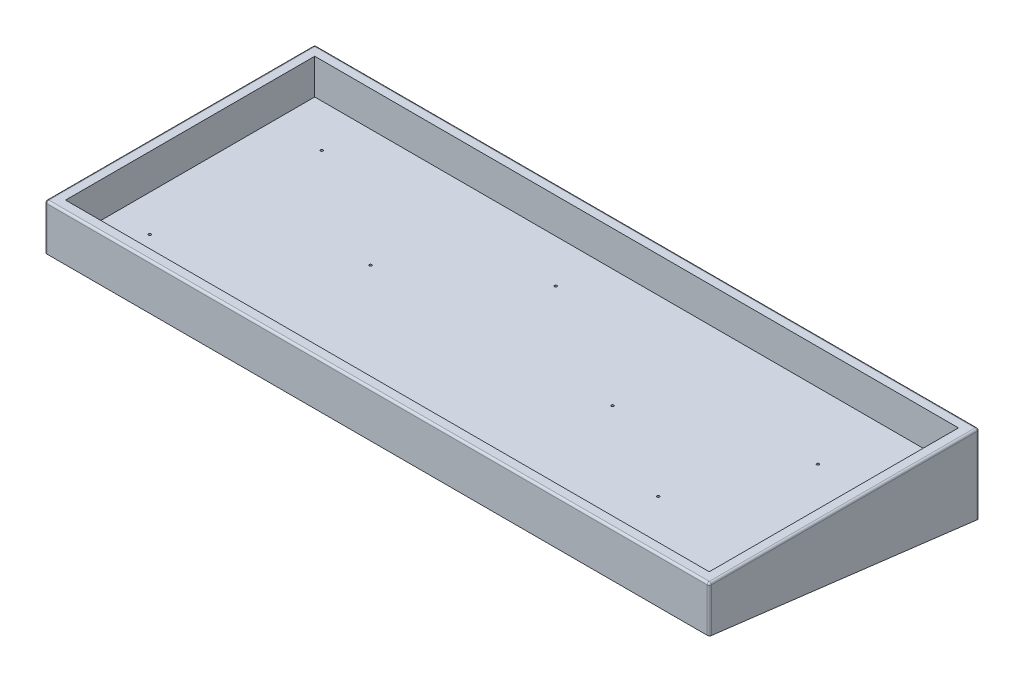
ISO-10303-21;
HEADER;
FILE_DESCRIPTION(('STEP AP214'),'2;1');
FILE_NAME('part.step','',(''),(''),'','','');
FILE_SCHEMA(('AUTOMOTIVE_DESIGN { 1 0 10303 214 1 1 1 1 }'));
ENDSEC;
DATA;
#1=APPLICATION_CONTEXT('core data for automotive mechanical design processes');
#2=APPLICATION_PROTOCOL_DEFINITION('international standard','automotive_design',2000,#1);
#3=PRODUCT_CONTEXT('',#1,'mechanical');
#4=PRODUCT('Part','Part','',(#3));
#5=PRODUCT_RELATED_PRODUCT_CATEGORY('part','',(#4));
#6=PRODUCT_DEFINITION_FORMATION('','',#4);
#7=PRODUCT_DEFINITION_CONTEXT('part definition',#1,'design');
#8=PRODUCT_DEFINITION('design','',#6,#7);
#9=PRODUCT_DEFINITION_SHAPE('','',#8);
#10=(LENGTH_UNIT() NAMED_UNIT(*) SI_UNIT(.MILLI.,.METRE.));
#11=(NAMED_UNIT(*) PLANE_ANGLE_UNIT() SI_UNIT($,.RADIAN.));
#12=(NAMED_UNIT(*) SI_UNIT($,.STERADIAN.) SOLID_ANGLE_UNIT());
#13=UNCERTAINTY_MEASURE_WITH_UNIT(LENGTH_MEASURE(1.E-05),#10,'distance_accuracy_value','');
#14=(GEOMETRIC_REPRESENTATION_CONTEXT(3) GLOBAL_UNCERTAINTY_ASSIGNED_CONTEXT((#13)) GLOBAL_UNIT_ASSIGNED_CONTEXT((#10,
#11,#12)) REPRESENTATION_CONTEXT('',''));
#15=CARTESIAN_POINT('',(0.,0.,0.));
#16=DIRECTION('',(0.,0.,1.));
#17=DIRECTION('',(1.,0.,0.));
#18=AXIS2_PLACEMENT_3D('',#15,#16,#17);
#19=CARTESIAN_POINT('',(0.,22.,0.));
#20=DIRECTION('',(1.,0.,0.));
#21=DIRECTION('',(0.,0.,-1.));
#22=AXIS2_PLACEMENT_3D('',#19,#20,#21);
#23=PLANE('',#22);
#24=DIRECTION('',(0.,0.,1.));
#25=VECTOR('',#24,1.);
#26=CARTESIAN_POINT('',(0.,21.,0.));
#27=LINE('',#26,#25);
#28=CARTESIAN_POINT('',(0.,21.,-1.));
#29=VERTEX_POINT('',#28);
#30=CARTESIAN_POINT('',(0.,21.,-129.));
#31=VERTEX_POINT('',#30);
#32=EDGE_CURVE('E267',#29,#31,#27,.F.);
#33=ORIENTED_EDGE('',*,*,#32,.T.);
#34=DIRECTION('',(0.,-1.,0.));
#35=VECTOR('',#34,1.);
#36=CARTESIAN_POINT('',(0.,22.,-129.));
#37=LINE('',#36,#35);
#38=CARTESIAN_POINT('',(0.,-15.8392083564747,-129.));
#39=VERTEX_POINT('',#38);
#40=EDGE_CURVE('E273',#31,#39,#37,.T.);
#41=ORIENTED_EDGE('',*,*,#40,.T.);
#42=DIRECTION('',(0.,0.121869343405148,0.992546151641322));
#43=VECTOR('',#42,1.);
#44=CARTESIAN_POINT('',(0.,0.,0.));
#45=LINE('',#44,#43);
#46=CARTESIAN_POINT('',(0.,-0.122784560902905,-1.));
#47=VERTEX_POINT('',#46);
#48=EDGE_CURVE('E206',#39,#47,#45,.T.);
#49=ORIENTED_EDGE('',*,*,#48,.T.);
#50=DIRECTION('',(0.,-1.,0.));
#51=VECTOR('',#50,1.);
#52=CARTESIAN_POINT('',(0.,22.,-1.));
#53=LINE('',#52,#51);
#54=EDGE_CURVE('E270',#47,#29,#53,.F.);
#55=ORIENTED_EDGE('',*,*,#54,.T.);
#56=EDGE_LOOP('',(#33,#41,#49,#55));
#57=FACE_BOUND('',#56,.T.);
#58=ADVANCED_FACE('F49',(#57),#23,.F.);
#59=CARTESIAN_POINT('',(0.,22.,0.));
#60=DIRECTION('',(0.,0.,-1.));
#61=DIRECTION('',(-1.,0.,0.));
#62=AXIS2_PLACEMENT_3D('',#59,#60,#61);
#63=PLANE('',#62);
#64=DIRECTION('',(1.,0.,0.));
#65=VECTOR('',#64,1.);
#66=CARTESIAN_POINT('',(0.,0.,0.));
#67=LINE('',#66,#65);
#68=CARTESIAN_POINT('',(1.,0.,0.));
#69=VERTEX_POINT('',#68);
#70=CARTESIAN_POINT('',(319.,0.,0.));
#71=VERTEX_POINT('',#70);
#72=EDGE_CURVE('E212',#69,#71,#67,.T.);
#73=ORIENTED_EDGE('',*,*,#72,.T.);
#74=DIRECTION('',(0.,-1.,0.));
#75=VECTOR('',#74,1.);
#76=CARTESIAN_POINT('',(319.,22.,0.));
#77=LINE('',#76,#75);
#78=CARTESIAN_POINT('',(319.,21.,0.));
#79=VERTEX_POINT('',#78);
#80=EDGE_CURVE('E264',#71,#79,#77,.F.);
#81=ORIENTED_EDGE('',*,*,#80,.T.);
#82=DIRECTION('',(1.,0.,0.));
#83=VECTOR('',#82,1.);
#84=CARTESIAN_POINT('',(0.,21.,0.));
#85=LINE('',#84,#83);
#86=CARTESIAN_POINT('',(1.,21.,0.));
#87=VERTEX_POINT('',#86);
#88=EDGE_CURVE('E258',#79,#87,#85,.F.);
#89=ORIENTED_EDGE('',*,*,#88,.T.);
#90=DIRECTION('',(0.,-1.,0.));
#91=VECTOR('',#90,1.);
#92=CARTESIAN_POINT('',(1.,22.,0.));
#93=LINE('',#92,#91);
#94=EDGE_CURVE('E261',#87,#69,#93,.T.);
#95=ORIENTED_EDGE('',*,*,#94,.T.);
#96=EDGE_LOOP('',(#73,#81,#89,#95));
#97=FACE_BOUND('',#96,.T.);
#98=ADVANCED_FACE('F397',(#97),#63,.F.);
#99=CARTESIAN_POINT('',(320.,22.,0.));
#100=DIRECTION('',(-1.,0.,0.));
#101=DIRECTION('',(0.,0.,1.));
#102=AXIS2_PLACEMENT_3D('',#99,#100,#101);
#103=PLANE('',#102);
#104=DIRECTION('',(0.,-0.121869343405148,-0.992546151641322));
#105=VECTOR('',#104,1.);
#106=CARTESIAN_POINT('',(320.,0.,0.));
#107=LINE('',#106,#105);
#108=CARTESIAN_POINT('',(320.,-0.122784560902905,-1.));
#109=VERTEX_POINT('',#108);
#110=CARTESIAN_POINT('',(320.,-15.8392083564747,-129.));
#111=VERTEX_POINT('',#110);
#112=EDGE_CURVE('E216',#109,#111,#107,.T.);
#113=ORIENTED_EDGE('',*,*,#112,.T.);
#114=DIRECTION('',(0.,-1.,0.));
#115=VECTOR('',#114,1.);
#116=CARTESIAN_POINT('',(320.,22.,-129.));
#117=LINE('',#116,#115);
#118=CARTESIAN_POINT('',(320.,21.,-129.));
#119=VERTEX_POINT('',#118);
#120=EDGE_CURVE('E255',#111,#119,#117,.F.);
#121=ORIENTED_EDGE('',*,*,#120,.T.);
#122=DIRECTION('',(0.,0.,-1.));
#123=VECTOR('',#122,1.);
#124=CARTESIAN_POINT('',(320.,21.,0.));
#125=LINE('',#124,#123);
#126=CARTESIAN_POINT('',(320.,21.,-1.));
#127=VERTEX_POINT('',#126);
#128=EDGE_CURVE('E249',#119,#127,#125,.F.);
#129=ORIENTED_EDGE('',*,*,#128,.T.);
#130=DIRECTION('',(0.,-1.,0.));
#131=VECTOR('',#130,1.);
#132=CARTESIAN_POINT('',(320.,22.,-1.));
#133=LINE('',#132,#131);
#134=EDGE_CURVE('E252',#127,#109,#133,.T.);
#135=ORIENTED_EDGE('',*,*,#134,.T.);
#136=EDGE_LOOP('',(#113,#121,#129,#135));
#137=FACE_BOUND('',#136,.T.);
#138=ADVANCED_FACE('F403',(#137),#103,.F.);
#139=CARTESIAN_POINT('',(0.,22.,-130.));
#140=DIRECTION('',(0.,0.,1.));
#141=DIRECTION('',(1.,0.,0.));
#142=AXIS2_PLACEMENT_3D('',#139,#140,#141);
#143=PLANE('',#142);
#144=DIRECTION('',(-1.,0.,0.));
#145=VECTOR('',#144,1.);
#146=CARTESIAN_POINT('',(0.,21.,-130.));
#147=LINE('',#146,#145);
#148=CARTESIAN_POINT('',(1.,21.,-130.));
#149=VERTEX_POINT('',#148);
#150=CARTESIAN_POINT('',(319.,21.,-130.));
#151=VERTEX_POINT('',#150);
#152=EDGE_CURVE('E227',#149,#151,#147,.F.);
#153=ORIENTED_EDGE('',*,*,#152,.T.);
#154=DIRECTION('',(0.,-1.,0.));
#155=VECTOR('',#154,1.);
#156=CARTESIAN_POINT('',(319.,22.,-130.));
#157=LINE('',#156,#155);
#158=CARTESIAN_POINT('',(319.,-15.9619929173776,-130.));
#159=VERTEX_POINT('',#158);
#160=EDGE_CURVE('E233',#151,#159,#157,.T.);
#161=ORIENTED_EDGE('',*,*,#160,.T.);
#162=DIRECTION('',(-1.,0.,0.));
#163=VECTOR('',#162,1.);
#164=CARTESIAN_POINT('',(0.,-15.9619929173776,-130.));
#165=LINE('',#164,#163);
#166=CARTESIAN_POINT('',(1.,-15.9619929173776,-130.));
#167=VERTEX_POINT('',#166);
#168=EDGE_CURVE('E223',#159,#167,#165,.T.);
#169=ORIENTED_EDGE('',*,*,#168,.T.);
#170=DIRECTION('',(0.,-1.,0.));
#171=VECTOR('',#170,1.);
#172=CARTESIAN_POINT('',(1.,22.,-130.));
#173=LINE('',#172,#171);
#174=EDGE_CURVE('E230',#167,#149,#173,.F.);
#175=ORIENTED_EDGE('',*,*,#174,.T.);
#176=EDGE_LOOP('',(#153,#161,#169,#175));
#177=FACE_BOUND('',#176,.T.);
#178=ADVANCED_FACE('F469',(#177),#143,.F.);
#179=CARTESIAN_POINT('',(0.,22.,0.));
#180=DIRECTION('',(0.,-1.,0.));
#181=DIRECTION('',(0.,0.,-1.));
#182=AXIS2_PLACEMENT_3D('',#179,#180,#181);
#183=PLANE('',#182);
#184=DIRECTION('',(-1.,0.,0.));
#185=VECTOR('',#184,1.);
#186=CARTESIAN_POINT('',(0.,22.,-129.));
#187=LINE('',#186,#185);
#188=CARTESIAN_POINT('',(319.,22.,-129.));
#189=VERTEX_POINT('',#188);
#190=CARTESIAN_POINT('',(1.,22.,-129.));
#191=VERTEX_POINT('',#190);
#192=EDGE_CURVE('E59',#189,#191,#187,.T.);
#193=ORIENTED_EDGE('',*,*,#192,.T.);
#194=DIRECTION('',(0.,0.,1.));
#195=VECTOR('',#194,1.);
#196=CARTESIAN_POINT('',(1.,22.,0.));
#197=LINE('',#196,#195);
#198=CARTESIAN_POINT('',(1.,22.,-1.));
#199=VERTEX_POINT('',#198);
#200=EDGE_CURVE('E11',#191,#199,#197,.T.);
#201=ORIENTED_EDGE('',*,*,#200,.T.);
#202=DIRECTION('',(1.,0.,0.));
#203=VECTOR('',#202,1.);
#204=CARTESIAN_POINT('',(0.,22.,-1.));
#205=LINE('',#204,#203);
#206=CARTESIAN_POINT('',(319.,22.,-1.));
#207=VERTEX_POINT('',#206);
#208=EDGE_CURVE('E73',#199,#207,#205,.T.);
#209=ORIENTED_EDGE('',*,*,#208,.T.);
#210=DIRECTION('',(0.,0.,-1.));
#211=VECTOR('',#210,1.);
#212=CARTESIAN_POINT('',(319.,22.,0.));
#213=LINE('',#212,#211);
#214=EDGE_CURVE('E276',#207,#189,#213,.T.);
#215=ORIENTED_EDGE('',*,*,#214,.T.);
#216=EDGE_LOOP('',(#193,#201,#209,#215));
#217=FACE_BOUND('',#216,.T.);
#218=DIRECTION('',(0.,0.,1.));
#219=VECTOR('',#218,1.);
#220=CARTESIAN_POINT('',(5.,22.,-125.));
#221=LINE('',#220,#219);
#222=CARTESIAN_POINT('',(5.,22.,-125.));
#223=VERTEX_POINT('',#222);
#224=CARTESIAN_POINT('',(5.,22.,-5.));
#225=VERTEX_POINT('',#224);
#226=EDGE_CURVE('E196',#223,#225,#221,.T.);
#227=ORIENTED_EDGE('',*,*,#226,.F.);
#228=DIRECTION('',(-1.,0.,0.));
#229=VECTOR('',#228,1.);
#230=CARTESIAN_POINT('',(315.,22.,-125.));
#231=LINE('',#230,#229);
#232=CARTESIAN_POINT('',(315.,22.,-125.));
#233=VERTEX_POINT('',#232);
#234=EDGE_CURVE('E160',#233,#223,#231,.T.);
#235=ORIENTED_EDGE('',*,*,#234,.F.);
#236=DIRECTION('',(0.,0.,-1.));
#237=VECTOR('',#236,1.);
#238=CARTESIAN_POINT('',(315.,22.,-5.));
#239=LINE('',#238,#237);
#240=CARTESIAN_POINT('',(315.,22.,-5.));
#241=VERTEX_POINT('',#240);
#242=EDGE_CURVE('E180',#241,#233,#239,.T.);
#243=ORIENTED_EDGE('',*,*,#242,.F.);
#244=DIRECTION('',(1.,0.,0.));
#245=VECTOR('',#244,1.);
#246=CARTESIAN_POINT('',(5.,22.,-5.));
#247=LINE('',#246,#245);
#248=EDGE_CURVE('E184',#225,#241,#247,.T.);
#249=ORIENTED_EDGE('',*,*,#248,.F.);
#250=EDGE_LOOP('',(#227,#235,#243,#249));
#251=FACE_BOUND('',#250,.T.);
#252=ADVANCED_FACE('F411',(#217,#251),#183,.F.);
#253=CARTESIAN_POINT('',(0.,0.,0.));
#254=DIRECTION('',(0.,-0.992546151641322,0.121869343405148));
#255=DIRECTION('',(0.,-0.121869343405148,-0.992546151641322));
#256=AXIS2_PLACEMENT_3D('',#253,#254,#255);
#257=PLANE('',#256);
#258=CARTESIAN_POINT('',(28.9711100203235,-12.822626306714,-104.431910758339));
#259=DIRECTION('',(0.,-0.992546151641322,0.121869343405148));
#260=DIRECTION('',(0.,0.121869343405148,0.992546151641322));
#261=AXIS2_PLACEMENT_3D('',#258,#259,#260);
#262=ELLIPSE('',#261,0.600103077338052,0.595629999999998);
#263=CARTESIAN_POINT('',(28.9711100203235,-12.7494921387034,-103.836280758339));
#264=VERTEX_POINT('',#263);
#265=EDGE_CURVE('E53',#264,#264,#262,.T.);
#266=ORIENTED_EDGE('',*,*,#265,.F.);
#267=EDGE_LOOP('',(#266));
#268=FACE_BOUND('',#267,.T.);
#269=CARTESIAN_POINT('',(141.933618189267,-12.7856395014766,-104.130677403222));
#270=DIRECTION('',(0.,-0.992546151641322,0.121869343405148));
#271=DIRECTION('',(0.,0.121869343405148,0.992546151641322));
#272=AXIS2_PLACEMENT_3D('',#269,#270,#271);
#273=ELLIPSE('',#272,0.60010307733804,0.595629999999986);
#274=CARTESIAN_POINT('',(141.933618189267,-12.712505333466,-103.535047403222));
#275=VERTEX_POINT('',#274);
#276=EDGE_CURVE('E773',#275,#275,#273,.T.);
#277=ORIENTED_EDGE('',*,*,#276,.F.);
#278=EDGE_LOOP('',(#277));
#279=FACE_BOUND('',#278,.T.);
#280=CARTESIAN_POINT('',(88.6153143335257,-8.38420967822933,-68.2839081442769));
#281=DIRECTION('',(0.,-0.992546151641322,0.121869343405148));
#282=DIRECTION('',(0.,0.121869343405148,0.992546151641322));
#283=AXIS2_PLACEMENT_3D('',#280,#281,#282);
#284=ELLIPSE('',#283,0.600103077338054,0.59563);
#285=CARTESIAN_POINT('',(88.6153143335257,-8.31107551021873,-67.6882781442769));
#286=VERTEX_POINT('',#285);
#287=EDGE_CURVE('E354',#286,#286,#284,.T.);
#288=ORIENTED_EDGE('',*,*,#287,.F.);
#289=EDGE_LOOP('',(#288));
#290=FACE_BOUND('',#289,.T.);
#291=CARTESIAN_POINT('',(205.493856118993,-8.34722287299195,-67.9826747891597));
#292=DIRECTION('',(0.,-0.992546151641322,0.121869343405148));
#293=DIRECTION('',(0.,0.121869343405148,0.992546151641322));
#294=AXIS2_PLACEMENT_3D('',#291,#292,#293);
#295=ELLIPSE('',#294,0.60010307733804,0.595629999999986);
#296=CARTESIAN_POINT('',(205.493856118993,-8.27408870498136,-67.3870447891597));
#297=VERTEX_POINT('',#296);
#298=EDGE_CURVE('E343',#297,#297,#295,.T.);
#299=ORIENTED_EDGE('',*,*,#298,.F.);
#300=EDGE_LOOP('',(#299));
#301=FACE_BOUND('',#300,.T.);
#302=CARTESIAN_POINT('',(254.293659647976,-5.05539720686584,-41.1729061837304));
#303=DIRECTION('',(0.,-0.992546151641322,0.121869343405148));
#304=DIRECTION('',(0.,0.121869343405148,0.992546151641322));
#305=AXIS2_PLACEMENT_3D('',#302,#303,#304);
#306=ELLIPSE('',#305,0.600103077338068,0.595630000000014);
#307=CARTESIAN_POINT('',(254.293659647976,-4.98226303885524,-40.5772761837304));
#308=VERTEX_POINT('',#307);
#309=EDGE_CURVE('E339',#308,#308,#306,.T.);
#310=ORIENTED_EDGE('',*,*,#309,.F.);
#311=EDGE_LOOP('',(#310));
#312=FACE_BOUND('',#311,.T.);
#313=CARTESIAN_POINT('',(279.296028122702,-11.4171277076938,-92.9850432638859));
#314=DIRECTION('',(0.,-0.992546151641322,0.121869343405148));
#315=DIRECTION('',(0.,0.121869343405148,0.992546151641322));
#316=AXIS2_PLACEMENT_3D('',#313,#314,#315);
#317=ELLIPSE('',#316,0.600103077338068,0.595630000000014);
#318=CARTESIAN_POINT('',(279.296028122702,-11.3439935396832,-92.3894132638859));
#319=VERTEX_POINT('',#318);
#320=EDGE_CURVE('E333',#319,#319,#317,.T.);
#321=ORIENTED_EDGE('',*,*,#320,.F.);
#322=EDGE_LOOP('',(#321));
#323=FACE_BOUND('',#322,.T.);
#324=CARTESIAN_POINT('',(22.6452095628627,-3.42797777642146,-27.9186385585744));
#325=DIRECTION('',(0.,-0.992546151641322,0.121869343405148));
#326=DIRECTION('',(0.,0.121869343405148,0.992546151641322));
#327=AXIS2_PLACEMENT_3D('',#324,#325,#326);
#328=ELLIPSE('',#327,0.600103077338052,0.595629999999998);
#329=CARTESIAN_POINT('',(22.6452095628627,-3.35484360841087,-27.3230085585744));
#330=VERTEX_POINT('',#329);
#331=EDGE_CURVE('E369',#330,#330,#328,.T.);
#332=ORIENTED_EDGE('',*,*,#331,.F.);
#333=EDGE_LOOP('',(#332));
#334=FACE_BOUND('',#333,.T.);
#335=CARTESIAN_POINT('',(168.140920084462,-2.54029445072454,-20.689038035762));
#336=DIRECTION('',(0.,-0.992546151641322,0.121869343405148));
#337=DIRECTION('',(0.,0.121869343405148,0.992546151641322));
#338=AXIS2_PLACEMENT_3D('',#335,#336,#337);
#339=ELLIPSE('',#338,0.60010307733804,0.595629999999986);
#340=CARTESIAN_POINT('',(168.140920084462,-2.46716028271394,-20.093408035762));
#341=VERTEX_POINT('',#340);
#342=EDGE_CURVE('E288',#341,#341,#339,.T.);
#343=ORIENTED_EDGE('',*,*,#342,.F.);
#344=EDGE_LOOP('',(#343));
#345=FACE_BOUND('',#344,.T.);
#346=ORIENTED_EDGE('',*,*,#168,.F.);
#347=CARTESIAN_POINT('',(319.,-15.8392083564747,-129.));
#348=DIRECTION('',(0.,-0.992546151641322,0.121869343405148));
#349=DIRECTION('',(0.,-0.121869343405148,-0.992546151641322));
#350=AXIS2_PLACEMENT_3D('',#347,#348,#349);
#351=ELLIPSE('',#350,1.00750982545885,1.);
#352=EDGE_CURVE('E246',#159,#111,#351,.T.);
#353=ORIENTED_EDGE('',*,*,#352,.T.);
#354=ORIENTED_EDGE('',*,*,#112,.F.);
#355=CARTESIAN_POINT('',(319.,-0.122784560902905,-1.));
#356=DIRECTION('',(0.,-0.992546151641322,0.121869343405148));
#357=DIRECTION('',(0.,-0.121869343405148,-0.992546151641322));
#358=AXIS2_PLACEMENT_3D('',#355,#356,#357);
#359=ELLIPSE('',#358,1.00750982545885,1.);
#360=EDGE_CURVE('E243',#109,#71,#359,.T.);
#361=ORIENTED_EDGE('',*,*,#360,.T.);
#362=ORIENTED_EDGE('',*,*,#72,.F.);
#363=CARTESIAN_POINT('',(1.,-0.122784560902905,-1.));
#364=DIRECTION('',(0.,-0.992546151641322,0.121869343405148));
#365=DIRECTION('',(0.,-0.121869343405148,-0.992546151641322));
#366=AXIS2_PLACEMENT_3D('',#363,#364,#365);
#367=ELLIPSE('',#366,1.00750982545885,1.);
#368=EDGE_CURVE('E237',#69,#47,#367,.T.);
#369=ORIENTED_EDGE('',*,*,#368,.T.);
#370=ORIENTED_EDGE('',*,*,#48,.F.);
#371=CARTESIAN_POINT('',(1.,-15.8392083564747,-129.));
#372=DIRECTION('',(0.,-0.992546151641322,0.121869343405148));
#373=DIRECTION('',(0.,-0.121869343405148,-0.992546151641322));
#374=AXIS2_PLACEMENT_3D('',#371,#372,#373);
#375=ELLIPSE('',#374,1.00750982545885,1.);
#376=EDGE_CURVE('E240',#39,#167,#375,.T.);
#377=ORIENTED_EDGE('',*,*,#376,.T.);
#378=EDGE_LOOP('',(#346,#353,#354,#361,#362,#369,#370,#377));
#379=FACE_BOUND('',#378,.T.);
#380=ADVANCED_FACE('F408',(#268,#279,#290,#301,#312,#323,#334,#345,#379),#257,.T.);
#381=CARTESIAN_POINT('',(315.,5.,-125.));
#382=DIRECTION('',(0.,0.,-1.));
#383=DIRECTION('',(-1.,0.,0.));
#384=AXIS2_PLACEMENT_3D('',#381,#382,#383);
#385=PLANE('',#384);
#386=ORIENTED_EDGE('',*,*,#234,.T.);
#387=DIRECTION('',(0.,1.,0.));
#388=VECTOR('',#387,1.);
#389=CARTESIAN_POINT('',(5.,5.,-125.));
#390=LINE('',#389,#388);
#391=CARTESIAN_POINT('',(5.,5.,-125.));
#392=VERTEX_POINT('',#391);
#393=EDGE_CURVE('E153',#392,#223,#390,.T.);
#394=ORIENTED_EDGE('',*,*,#393,.F.);
#395=DIRECTION('',(-1.,0.,0.));
#396=VECTOR('',#395,1.);
#397=CARTESIAN_POINT('',(315.,5.,-125.));
#398=LINE('',#397,#396);
#399=CARTESIAN_POINT('',(315.,5.,-125.));
#400=VERTEX_POINT('',#399);
#401=EDGE_CURVE('E157',#400,#392,#398,.T.);
#402=ORIENTED_EDGE('',*,*,#401,.F.);
#403=DIRECTION('',(0.,1.,0.));
#404=VECTOR('',#403,1.);
#405=CARTESIAN_POINT('',(315.,5.,-125.));
#406=LINE('',#405,#404);
#407=EDGE_CURVE('E203',#400,#233,#406,.T.);
#408=ORIENTED_EDGE('',*,*,#407,.T.);
#409=EDGE_LOOP('',(#386,#394,#402,#408));
#410=FACE_BOUND('',#409,.T.);
#411=ADVANCED_FACE('F155',(#410),#385,.F.);
#412=CARTESIAN_POINT('',(315.,5.,-5.));
#413=DIRECTION('',(1.,0.,0.));
#414=DIRECTION('',(0.,0.,-1.));
#415=AXIS2_PLACEMENT_3D('',#412,#413,#414);
#416=PLANE('',#415);
#417=ORIENTED_EDGE('',*,*,#242,.T.);
#418=ORIENTED_EDGE('',*,*,#407,.F.);
#419=DIRECTION('',(0.,0.,-1.));
#420=VECTOR('',#419,1.);
#421=CARTESIAN_POINT('',(315.,5.,-5.));
#422=LINE('',#421,#420);
#423=CARTESIAN_POINT('',(315.,5.,-5.));
#424=VERTEX_POINT('',#423);
#425=EDGE_CURVE('E166',#424,#400,#422,.T.);
#426=ORIENTED_EDGE('',*,*,#425,.F.);
#427=DIRECTION('',(0.,1.,0.));
#428=VECTOR('',#427,1.);
#429=CARTESIAN_POINT('',(315.,5.,-5.));
#430=LINE('',#429,#428);
#431=EDGE_CURVE('E207',#424,#241,#430,.T.);
#432=ORIENTED_EDGE('',*,*,#431,.T.);
#433=EDGE_LOOP('',(#417,#418,#426,#432));
#434=FACE_BOUND('',#433,.T.);
#435=ADVANCED_FACE('F496',(#434),#416,.F.);
#436=CARTESIAN_POINT('',(5.,5.,-5.));
#437=DIRECTION('',(0.,0.,1.));
#438=DIRECTION('',(1.,0.,0.));
#439=AXIS2_PLACEMENT_3D('',#436,#437,#438);
#440=PLANE('',#439);
#441=ORIENTED_EDGE('',*,*,#248,.T.);
#442=ORIENTED_EDGE('',*,*,#431,.F.);
#443=DIRECTION('',(1.,0.,0.));
#444=VECTOR('',#443,1.);
#445=CARTESIAN_POINT('',(5.,5.,-5.));
#446=LINE('',#445,#444);
#447=CARTESIAN_POINT('',(5.,5.,-5.));
#448=VERTEX_POINT('',#447);
#449=EDGE_CURVE('E175',#448,#424,#446,.T.);
#450=ORIENTED_EDGE('',*,*,#449,.F.);
#451=DIRECTION('',(0.,1.,0.));
#452=VECTOR('',#451,1.);
#453=CARTESIAN_POINT('',(5.,5.,-5.));
#454=LINE('',#453,#452);
#455=EDGE_CURVE('E165',#448,#225,#454,.T.);
#456=ORIENTED_EDGE('',*,*,#455,.T.);
#457=EDGE_LOOP('',(#441,#442,#450,#456));
#458=FACE_BOUND('',#457,.T.);
#459=ADVANCED_FACE('F390',(#458),#440,.F.);
#460=CARTESIAN_POINT('',(5.,5.,-125.));
#461=DIRECTION('',(-1.,0.,0.));
#462=DIRECTION('',(0.,0.,1.));
#463=AXIS2_PLACEMENT_3D('',#460,#461,#462);
#464=PLANE('',#463);
#465=ORIENTED_EDGE('',*,*,#226,.T.);
#466=ORIENTED_EDGE('',*,*,#455,.F.);
#467=DIRECTION('',(0.,0.,1.));
#468=VECTOR('',#467,1.);
#469=CARTESIAN_POINT('',(5.,5.,-125.));
#470=LINE('',#469,#468);
#471=EDGE_CURVE('E169',#392,#448,#470,.T.);
#472=ORIENTED_EDGE('',*,*,#471,.F.);
#473=ORIENTED_EDGE('',*,*,#393,.T.);
#474=EDGE_LOOP('',(#465,#466,#472,#473));
#475=FACE_BOUND('',#474,.T.);
#476=ADVANCED_FACE('F170',(#475),#464,.F.);
#477=CARTESIAN_POINT('',(0.,5.,0.));
#478=DIRECTION('',(0.,1.,0.));
#479=DIRECTION('',(0.,0.,1.));
#480=AXIS2_PLACEMENT_3D('',#477,#478,#479);
#481=PLANE('',#480);
#482=CARTESIAN_POINT('',(28.9711100203235,5.,-104.431910758339));
#483=DIRECTION('',(0.,1.,0.));
#484=DIRECTION('',(0.,0.,1.));
#485=AXIS2_PLACEMENT_3D('',#482,#483,#484);
#486=CIRCLE('',#485,0.59563);
#487=CARTESIAN_POINT('',(28.9711100203235,5.,-103.836280758339));
#488=VERTEX_POINT('',#487);
#489=EDGE_CURVE('E764',#488,#488,#486,.T.);
#490=ORIENTED_EDGE('',*,*,#489,.F.);
#491=EDGE_LOOP('',(#490));
#492=FACE_BOUND('',#491,.T.);
#493=CARTESIAN_POINT('',(141.933618189267,5.,-104.130677403222));
#494=DIRECTION('',(0.,1.,0.));
#495=DIRECTION('',(0.,0.,1.));
#496=AXIS2_PLACEMENT_3D('',#493,#494,#495);
#497=CIRCLE('',#496,0.595629999999986);
#498=CARTESIAN_POINT('',(141.933618189267,5.,-103.535047403222));
#499=VERTEX_POINT('',#498);
#500=EDGE_CURVE('E768',#499,#499,#497,.T.);
#501=ORIENTED_EDGE('',*,*,#500,.F.);
#502=EDGE_LOOP('',(#501));
#503=FACE_BOUND('',#502,.T.);
#504=CARTESIAN_POINT('',(88.6153143335257,5.,-68.2839081442769));
#505=DIRECTION('',(0.,1.,0.));
#506=DIRECTION('',(0.,0.,1.));
#507=AXIS2_PLACEMENT_3D('',#504,#505,#506);
#508=CIRCLE('',#507,0.59563);
#509=CARTESIAN_POINT('',(88.6153143335257,5.,-67.6882781442769));
#510=VERTEX_POINT('',#509);
#511=EDGE_CURVE('E360',#510,#510,#508,.T.);
#512=ORIENTED_EDGE('',*,*,#511,.F.);
#513=EDGE_LOOP('',(#512));
#514=FACE_BOUND('',#513,.T.);
#515=CARTESIAN_POINT('',(205.493856118993,5.,-67.9826747891597));
#516=DIRECTION('',(0.,1.,0.));
#517=DIRECTION('',(0.,0.,1.));
#518=AXIS2_PLACEMENT_3D('',#515,#516,#517);
#519=CIRCLE('',#518,0.595629999999986);
#520=CARTESIAN_POINT('',(205.493856118993,5.,-67.3870447891597));
#521=VERTEX_POINT('',#520);
#522=EDGE_CURVE('E346',#521,#521,#519,.T.);
#523=ORIENTED_EDGE('',*,*,#522,.F.);
#524=EDGE_LOOP('',(#523));
#525=FACE_BOUND('',#524,.T.);
#526=CARTESIAN_POINT('',(254.293659647976,5.,-41.1729061837304));
#527=DIRECTION('',(0.,1.,0.));
#528=DIRECTION('',(0.,0.,1.));
#529=AXIS2_PLACEMENT_3D('',#526,#527,#528);
#530=CIRCLE('',#529,0.595630000000014);
#531=CARTESIAN_POINT('',(254.293659647976,5.,-40.5772761837304));
#532=VERTEX_POINT('',#531);
#533=EDGE_CURVE('E342',#532,#532,#530,.T.);
#534=ORIENTED_EDGE('',*,*,#533,.F.);
#535=EDGE_LOOP('',(#534));
#536=FACE_BOUND('',#535,.T.);
#537=CARTESIAN_POINT('',(279.296028122702,5.,-92.9850432638859));
#538=DIRECTION('',(0.,1.,0.));
#539=DIRECTION('',(0.,0.,1.));
#540=AXIS2_PLACEMENT_3D('',#537,#538,#539);
#541=CIRCLE('',#540,0.595630000000014);
#542=CARTESIAN_POINT('',(279.296028122702,5.,-92.3894132638859));
#543=VERTEX_POINT('',#542);
#544=EDGE_CURVE('E338',#543,#543,#541,.T.);
#545=ORIENTED_EDGE('',*,*,#544,.F.);
#546=EDGE_LOOP('',(#545));
#547=FACE_BOUND('',#546,.T.);
#548=CARTESIAN_POINT('',(22.6452095628627,5.,-27.9186385585744));
#549=DIRECTION('',(0.,1.,0.));
#550=DIRECTION('',(0.,0.,1.));
#551=AXIS2_PLACEMENT_3D('',#548,#549,#550);
#552=CIRCLE('',#551,0.59563);
#553=CARTESIAN_POINT('',(22.6452095628627,5.,-27.3230085585744));
#554=VERTEX_POINT('',#553);
#555=EDGE_CURVE('E337',#554,#554,#552,.T.);
#556=ORIENTED_EDGE('',*,*,#555,.F.);
#557=EDGE_LOOP('',(#556));
#558=FACE_BOUND('',#557,.T.);
#559=CARTESIAN_POINT('',(168.140920084462,5.,-20.689038035762));
#560=DIRECTION('',(0.,1.,0.));
#561=DIRECTION('',(0.,0.,1.));
#562=AXIS2_PLACEMENT_3D('',#559,#560,#561);
#563=CIRCLE('',#562,0.595629999999986);
#564=CARTESIAN_POINT('',(168.140920084462,5.,-20.093408035762));
#565=VERTEX_POINT('',#564);
#566=EDGE_CURVE('E187',#565,#565,#563,.T.);
#567=ORIENTED_EDGE('',*,*,#566,.F.);
#568=EDGE_LOOP('',(#567));
#569=FACE_BOUND('',#568,.T.);
#570=ORIENTED_EDGE('',*,*,#401,.T.);
#571=ORIENTED_EDGE('',*,*,#471,.T.);
#572=ORIENTED_EDGE('',*,*,#449,.T.);
#573=ORIENTED_EDGE('',*,*,#425,.T.);
#574=EDGE_LOOP('',(#570,#571,#572,#573));
#575=FACE_BOUND('',#574,.T.);
#576=ADVANCED_FACE('F177',(#492,#503,#514,#525,#536,#547,#558,#569,#575),#481,.T.);
#577=CARTESIAN_POINT('',(1.,22.,-1.));
#578=DIRECTION('',(0.,-1.,0.));
#579=DIRECTION('',(0.,0.,-1.));
#580=AXIS2_PLACEMENT_3D('',#577,#578,#579);
#581=CYLINDRICAL_SURFACE('',#580,1.);
#582=CARTESIAN_POINT('',(1.,21.,-1.));
#583=DIRECTION('',(0.,1.,0.));
#584=DIRECTION('',(0.,0.,1.));
#585=AXIS2_PLACEMENT_3D('',#582,#583,#584);
#586=CIRCLE('',#585,1.);
#587=EDGE_CURVE('E197',#29,#87,#586,.T.);
#588=ORIENTED_EDGE('',*,*,#587,.F.);
#589=ORIENTED_EDGE('',*,*,#54,.F.);
#590=ORIENTED_EDGE('',*,*,#368,.F.);
#591=ORIENTED_EDGE('',*,*,#94,.F.);
#592=EDGE_LOOP('',(#588,#589,#590,#591));
#593=FACE_BOUND('',#592,.T.);
#594=ADVANCED_FACE('F51',(#593),#581,.T.);
#595=CARTESIAN_POINT('',(1.,21.,-1.));
#596=DIRECTION('',(0.,0.,1.));
#597=DIRECTION('',(1.,0.,0.));
#598=AXIS2_PLACEMENT_3D('',#595,#596,#597);
#599=SPHERICAL_SURFACE('',#598,1.);
#600=CARTESIAN_POINT('',(1.,21.,-1.));
#601=DIRECTION('',(0.,0.,1.));
#602=DIRECTION('',(1.,0.,0.));
#603=AXIS2_PLACEMENT_3D('',#600,#601,#602);
#604=CIRCLE('',#603,1.);
#605=EDGE_CURVE('E320',#29,#199,#604,.F.);
#606=ORIENTED_EDGE('',*,*,#605,.F.);
#607=ORIENTED_EDGE('',*,*,#587,.T.);
#608=CARTESIAN_POINT('',(1.,21.,-1.));
#609=DIRECTION('',(-1.,0.,0.));
#610=DIRECTION('',(0.,0.,1.));
#611=AXIS2_PLACEMENT_3D('',#608,#609,#610);
#612=CIRCLE('',#611,1.);
#613=EDGE_CURVE('E324',#199,#87,#612,.F.);
#614=ORIENTED_EDGE('',*,*,#613,.F.);
#615=EDGE_LOOP('',(#606,#607,#614));
#616=FACE_BOUND('',#615,.T.);
#617=ADVANCED_FACE('F387',(#616),#599,.T.);
#618=CARTESIAN_POINT('',(319.,22.,-1.));
#619=DIRECTION('',(0.,-1.,0.));
#620=DIRECTION('',(0.,0.,-1.));
#621=AXIS2_PLACEMENT_3D('',#618,#619,#620);
#622=CYLINDRICAL_SURFACE('',#621,1.);
#623=ORIENTED_EDGE('',*,*,#360,.F.);
#624=ORIENTED_EDGE('',*,*,#134,.F.);
#625=CARTESIAN_POINT('',(319.,21.,-1.));
#626=DIRECTION('',(0.,1.,0.));
#627=DIRECTION('',(0.,0.,1.));
#628=AXIS2_PLACEMENT_3D('',#625,#626,#627);
#629=CIRCLE('',#628,1.);
#630=EDGE_CURVE('E316',#79,#127,#629,.T.);
#631=ORIENTED_EDGE('',*,*,#630,.F.);
#632=ORIENTED_EDGE('',*,*,#80,.F.);
#633=EDGE_LOOP('',(#623,#624,#631,#632));
#634=FACE_BOUND('',#633,.T.);
#635=ADVANCED_FACE('F448',(#634),#622,.T.);
#636=CARTESIAN_POINT('',(0.,21.,-1.));
#637=DIRECTION('',(1.,0.,0.));
#638=DIRECTION('',(0.,0.,-1.));
#639=AXIS2_PLACEMENT_3D('',#636,#637,#638);
#640=CYLINDRICAL_SURFACE('',#639,1.);
#641=ORIENTED_EDGE('',*,*,#613,.T.);
#642=ORIENTED_EDGE('',*,*,#88,.F.);
#643=CARTESIAN_POINT('',(319.,21.,-1.));
#644=DIRECTION('',(1.,0.,0.));
#645=DIRECTION('',(0.,0.,-1.));
#646=AXIS2_PLACEMENT_3D('',#643,#644,#645);
#647=CIRCLE('',#646,1.);
#648=EDGE_CURVE('E312',#207,#79,#647,.T.);
#649=ORIENTED_EDGE('',*,*,#648,.F.);
#650=ORIENTED_EDGE('',*,*,#208,.F.);
#651=EDGE_LOOP('',(#641,#642,#649,#650));
#652=FACE_BOUND('',#651,.T.);
#653=ADVANCED_FACE('F444',(#652),#640,.T.);
#654=CARTESIAN_POINT('',(1.,21.,0.));
#655=DIRECTION('',(0.,0.,1.));
#656=DIRECTION('',(1.,0.,0.));
#657=AXIS2_PLACEMENT_3D('',#654,#655,#656);
#658=CYLINDRICAL_SURFACE('',#657,1.);
#659=ORIENTED_EDGE('',*,*,#605,.T.);
#660=ORIENTED_EDGE('',*,*,#200,.F.);
#661=CARTESIAN_POINT('',(1.,21.,-129.));
#662=DIRECTION('',(0.,0.,-1.));
#663=DIRECTION('',(-1.,0.,0.));
#664=AXIS2_PLACEMENT_3D('',#661,#662,#663);
#665=CIRCLE('',#664,1.);
#666=EDGE_CURVE('E308',#31,#191,#665,.T.);
#667=ORIENTED_EDGE('',*,*,#666,.F.);
#668=ORIENTED_EDGE('',*,*,#32,.F.);
#669=EDGE_LOOP('',(#659,#660,#667,#668));
#670=FACE_BOUND('',#669,.T.);
#671=ADVANCED_FACE('F440',(#670),#658,.T.);
#672=CARTESIAN_POINT('',(1.,22.,-129.));
#673=DIRECTION('',(0.,-1.,0.));
#674=DIRECTION('',(0.,0.,-1.));
#675=AXIS2_PLACEMENT_3D('',#672,#673,#674);
#676=CYLINDRICAL_SURFACE('',#675,1.);
#677=ORIENTED_EDGE('',*,*,#376,.F.);
#678=ORIENTED_EDGE('',*,*,#40,.F.);
#679=CARTESIAN_POINT('',(1.,21.,-129.));
#680=DIRECTION('',(0.,1.,0.));
#681=DIRECTION('',(0.,0.,1.));
#682=AXIS2_PLACEMENT_3D('',#679,#680,#681);
#683=CIRCLE('',#682,1.);
#684=EDGE_CURVE('E304',#149,#31,#683,.T.);
#685=ORIENTED_EDGE('',*,*,#684,.F.);
#686=ORIENTED_EDGE('',*,*,#174,.F.);
#687=EDGE_LOOP('',(#677,#678,#685,#686));
#688=FACE_BOUND('',#687,.T.);
#689=ADVANCED_FACE('F436',(#688),#676,.T.);
#690=CARTESIAN_POINT('',(319.,21.,-1.));
#691=DIRECTION('',(0.,0.,1.));
#692=DIRECTION('',(1.,0.,0.));
#693=AXIS2_PLACEMENT_3D('',#690,#691,#692);
#694=SPHERICAL_SURFACE('',#693,1.);
#695=ORIENTED_EDGE('',*,*,#648,.T.);
#696=ORIENTED_EDGE('',*,*,#630,.T.);
#697=CARTESIAN_POINT('',(319.,21.,-1.));
#698=DIRECTION('',(0.,0.,1.));
#699=DIRECTION('',(1.,0.,0.));
#700=AXIS2_PLACEMENT_3D('',#697,#698,#699);
#701=CIRCLE('',#700,1.);
#702=EDGE_CURVE('E300',#207,#127,#701,.F.);
#703=ORIENTED_EDGE('',*,*,#702,.F.);
#704=EDGE_LOOP('',(#695,#696,#703));
#705=FACE_BOUND('',#704,.T.);
#706=ADVANCED_FACE('F432',(#705),#694,.T.);
#707=CARTESIAN_POINT('',(1.,21.,-129.));
#708=DIRECTION('',(-1.,0.,0.));
#709=DIRECTION('',(0.,0.,1.));
#710=AXIS2_PLACEMENT_3D('',#707,#708,#709);
#711=SPHERICAL_SURFACE('',#710,1.);
#712=ORIENTED_EDGE('',*,*,#684,.T.);
#713=ORIENTED_EDGE('',*,*,#666,.T.);
#714=CARTESIAN_POINT('',(1.,21.,-129.));
#715=DIRECTION('',(-1.,0.,0.));
#716=DIRECTION('',(0.,0.,1.));
#717=AXIS2_PLACEMENT_3D('',#714,#715,#716);
#718=CIRCLE('',#717,1.);
#719=EDGE_CURVE('E296',#149,#191,#718,.F.);
#720=ORIENTED_EDGE('',*,*,#719,.F.);
#721=EDGE_LOOP('',(#712,#713,#720));
#722=FACE_BOUND('',#721,.T.);
#723=ADVANCED_FACE('F428',(#722),#711,.T.);
#724=CARTESIAN_POINT('',(319.,21.,0.));
#725=DIRECTION('',(0.,0.,-1.));
#726=DIRECTION('',(-1.,0.,0.));
#727=AXIS2_PLACEMENT_3D('',#724,#725,#726);
#728=CYLINDRICAL_SURFACE('',#727,1.);
#729=ORIENTED_EDGE('',*,*,#702,.T.);
#730=ORIENTED_EDGE('',*,*,#128,.F.);
#731=CARTESIAN_POINT('',(319.,21.,-129.));
#732=DIRECTION('',(0.,0.,-1.));
#733=DIRECTION('',(-1.,0.,0.));
#734=AXIS2_PLACEMENT_3D('',#731,#732,#733);
#735=CIRCLE('',#734,1.);
#736=EDGE_CURVE('E292',#189,#119,#735,.T.);
#737=ORIENTED_EDGE('',*,*,#736,.F.);
#738=ORIENTED_EDGE('',*,*,#214,.F.);
#739=EDGE_LOOP('',(#729,#730,#737,#738));
#740=FACE_BOUND('',#739,.T.);
#741=ADVANCED_FACE('F424',(#740),#728,.T.);
#742=CARTESIAN_POINT('',(0.,21.,-129.));
#743=DIRECTION('',(-1.,0.,0.));
#744=DIRECTION('',(0.,0.,1.));
#745=AXIS2_PLACEMENT_3D('',#742,#743,#744);
#746=CYLINDRICAL_SURFACE('',#745,1.);
#747=ORIENTED_EDGE('',*,*,#719,.T.);
#748=ORIENTED_EDGE('',*,*,#192,.F.);
#749=CARTESIAN_POINT('',(319.,21.,-129.));
#750=DIRECTION('',(1.,0.,0.));
#751=DIRECTION('',(0.,0.,-1.));
#752=AXIS2_PLACEMENT_3D('',#749,#750,#751);
#753=CIRCLE('',#752,1.);
#754=EDGE_CURVE('E287',#151,#189,#753,.T.);
#755=ORIENTED_EDGE('',*,*,#754,.F.);
#756=ORIENTED_EDGE('',*,*,#152,.F.);
#757=EDGE_LOOP('',(#747,#748,#755,#756));
#758=FACE_BOUND('',#757,.T.);
#759=ADVANCED_FACE('F420',(#758),#746,.T.);
#760=CARTESIAN_POINT('',(319.,21.,-129.));
#761=DIRECTION('',(0.,1.,0.));
#762=DIRECTION('',(0.,0.,1.));
#763=AXIS2_PLACEMENT_3D('',#760,#761,#762);
#764=SPHERICAL_SURFACE('',#763,1.);
#765=ORIENTED_EDGE('',*,*,#754,.T.);
#766=ORIENTED_EDGE('',*,*,#736,.T.);
#767=CARTESIAN_POINT('',(319.,21.,-129.));
#768=DIRECTION('',(0.,1.,0.));
#769=DIRECTION('',(0.,0.,1.));
#770=AXIS2_PLACEMENT_3D('',#767,#768,#769);
#771=CIRCLE('',#770,1.);
#772=EDGE_CURVE('E283',#151,#119,#771,.F.);
#773=ORIENTED_EDGE('',*,*,#772,.F.);
#774=EDGE_LOOP('',(#765,#766,#773));
#775=FACE_BOUND('',#774,.T.);
#776=ADVANCED_FACE('F416',(#775),#764,.T.);
#777=CARTESIAN_POINT('',(319.,22.,-129.));
#778=DIRECTION('',(0.,-1.,0.));
#779=DIRECTION('',(0.,0.,-1.));
#780=AXIS2_PLACEMENT_3D('',#777,#778,#779);
#781=CYLINDRICAL_SURFACE('',#780,1.);
#782=ORIENTED_EDGE('',*,*,#772,.T.);
#783=ORIENTED_EDGE('',*,*,#120,.F.);
#784=ORIENTED_EDGE('',*,*,#352,.F.);
#785=ORIENTED_EDGE('',*,*,#160,.F.);
#786=EDGE_LOOP('',(#782,#783,#784,#785));
#787=FACE_BOUND('',#786,.T.);
#788=ADVANCED_FACE('F413',(#787),#781,.T.);
#789=CARTESIAN_POINT('',(168.140920084462,5.,-20.689038035762));
#790=DIRECTION('',(0.,1.,0.));
#791=DIRECTION('',(0.,0.,1.));
#792=AXIS2_PLACEMENT_3D('',#789,#790,#791);
#793=CYLINDRICAL_SURFACE('',#792,0.595629999999986);
#794=ORIENTED_EDGE('',*,*,#342,.T.);
#795=EDGE_LOOP('',(#794));
#796=FACE_BOUND('',#795,.T.);
#797=ORIENTED_EDGE('',*,*,#566,.T.);
#798=EDGE_LOOP('',(#797));
#799=FACE_BOUND('',#798,.T.);
#800=ADVANCED_FACE('F378',(#796,#799),#793,.F.);
#801=CARTESIAN_POINT('',(22.6452095628627,5.,-27.9186385585744));
#802=DIRECTION('',(0.,1.,0.));
#803=DIRECTION('',(0.,0.,1.));
#804=AXIS2_PLACEMENT_3D('',#801,#802,#803);
#805=CYLINDRICAL_SURFACE('',#804,0.595629999999998);
#806=ORIENTED_EDGE('',*,*,#331,.T.);
#807=EDGE_LOOP('',(#806));
#808=FACE_BOUND('',#807,.T.);
#809=ORIENTED_EDGE('',*,*,#555,.T.);
#810=EDGE_LOOP('',(#809));
#811=FACE_BOUND('',#810,.T.);
#812=ADVANCED_FACE('F608',(#808,#811),#805,.F.);
#813=CARTESIAN_POINT('',(279.296028122702,5.,-92.9850432638859));
#814=DIRECTION('',(0.,1.,0.));
#815=DIRECTION('',(0.,0.,1.));
#816=AXIS2_PLACEMENT_3D('',#813,#814,#815);
#817=CYLINDRICAL_SURFACE('',#816,0.595630000000014);
#818=ORIENTED_EDGE('',*,*,#320,.T.);
#819=EDGE_LOOP('',(#818));
#820=FACE_BOUND('',#819,.T.);
#821=ORIENTED_EDGE('',*,*,#544,.T.);
#822=EDGE_LOOP('',(#821));
#823=FACE_BOUND('',#822,.T.);
#824=ADVANCED_FACE('F619',(#820,#823),#817,.F.);
#825=CARTESIAN_POINT('',(254.293659647976,5.,-41.1729061837304));
#826=DIRECTION('',(0.,1.,0.));
#827=DIRECTION('',(0.,0.,1.));
#828=AXIS2_PLACEMENT_3D('',#825,#826,#827);
#829=CYLINDRICAL_SURFACE('',#828,0.595630000000014);
#830=ORIENTED_EDGE('',*,*,#309,.T.);
#831=EDGE_LOOP('',(#830));
#832=FACE_BOUND('',#831,.T.);
#833=ORIENTED_EDGE('',*,*,#533,.T.);
#834=EDGE_LOOP('',(#833));
#835=FACE_BOUND('',#834,.T.);
#836=ADVANCED_FACE('F630',(#832,#835),#829,.F.);
#837=CARTESIAN_POINT('',(205.493856118993,5.,-67.9826747891597));
#838=DIRECTION('',(0.,1.,0.));
#839=DIRECTION('',(0.,0.,1.));
#840=AXIS2_PLACEMENT_3D('',#837,#838,#839);
#841=CYLINDRICAL_SURFACE('',#840,0.595629999999986);
#842=ORIENTED_EDGE('',*,*,#298,.T.);
#843=EDGE_LOOP('',(#842));
#844=FACE_BOUND('',#843,.T.);
#845=ORIENTED_EDGE('',*,*,#522,.T.);
#846=EDGE_LOOP('',(#845));
#847=FACE_BOUND('',#846,.T.);
#848=ADVANCED_FACE('F642',(#844,#847),#841,.F.);
#849=CARTESIAN_POINT('',(88.6153143335257,5.,-68.2839081442769));
#850=DIRECTION('',(0.,1.,0.));
#851=DIRECTION('',(0.,0.,1.));
#852=AXIS2_PLACEMENT_3D('',#849,#850,#851);
#853=CYLINDRICAL_SURFACE('',#852,0.59563);
#854=ORIENTED_EDGE('',*,*,#287,.T.);
#855=EDGE_LOOP('',(#854));
#856=FACE_BOUND('',#855,.T.);
#857=ORIENTED_EDGE('',*,*,#511,.T.);
#858=EDGE_LOOP('',(#857));
#859=FACE_BOUND('',#858,.T.);
#860=ADVANCED_FACE('F654',(#856,#859),#853,.F.);
#861=CARTESIAN_POINT('',(141.933618189267,5.,-104.130677403222));
#862=DIRECTION('',(0.,1.,0.));
#863=DIRECTION('',(0.,0.,1.));
#864=AXIS2_PLACEMENT_3D('',#861,#862,#863);
#865=CYLINDRICAL_SURFACE('',#864,0.595629999999986);
#866=ORIENTED_EDGE('',*,*,#276,.T.);
#867=EDGE_LOOP('',(#866));
#868=FACE_BOUND('',#867,.T.);
#869=ORIENTED_EDGE('',*,*,#500,.T.);
#870=EDGE_LOOP('',(#869));
#871=FACE_BOUND('',#870,.T.);
#872=ADVANCED_FACE('F665',(#868,#871),#865,.F.);
#873=CARTESIAN_POINT('',(28.9711100203235,5.,-104.431910758339));
#874=DIRECTION('',(0.,1.,0.));
#875=DIRECTION('',(0.,0.,1.));
#876=AXIS2_PLACEMENT_3D('',#873,#874,#875);
#877=CYLINDRICAL_SURFACE('',#876,0.595629999999998);
#878=ORIENTED_EDGE('',*,*,#265,.T.);
#879=EDGE_LOOP('',(#878));
#880=FACE_BOUND('',#879,.T.);
#881=ORIENTED_EDGE('',*,*,#489,.T.);
#882=EDGE_LOOP('',(#881));
#883=FACE_BOUND('',#882,.T.);
#884=ADVANCED_FACE('F677',(#880,#883),#877,.F.);
#885=CLOSED_SHELL('',(#58,#98,#138,#178,#252,#380,#411,#435,#459,#476,#576,#594,#617,#635,#653,
#671,#689,#706,#723,#741,#759,#776,#788,#800,#812,#824,#836,#848,#860,#872,#884));
#886=MANIFOLD_SOLID_BREP('B2',#885);
#887=ADVANCED_BREP_SHAPE_REPRESENTATION('',(#18,#886),#14);
#888=SHAPE_DEFINITION_REPRESENTATION(#9,#887);
ENDSEC;
END-ISO-10303-21;
